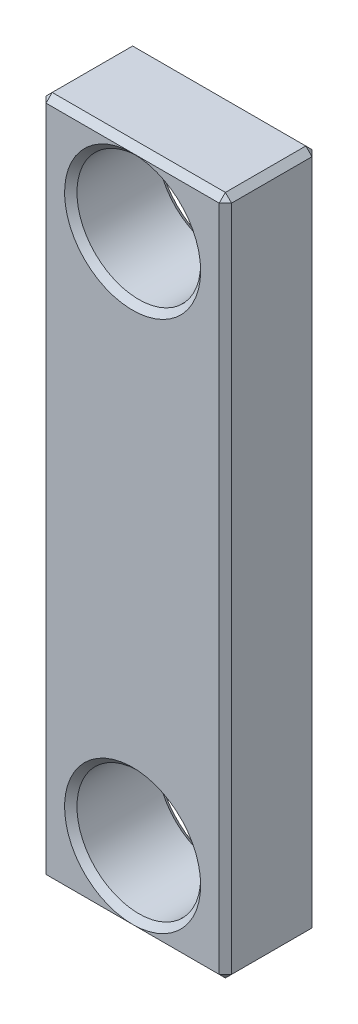
ISO-10303-21;
HEADER;
FILE_DESCRIPTION(('STEP AP214'),'2;1');
FILE_NAME('part.step','',(''),(''),'','','');
FILE_SCHEMA(('AUTOMOTIVE_DESIGN { 1 0 10303 214 1 1 1 1 }'));
ENDSEC;
DATA;
#1=APPLICATION_CONTEXT('core data for automotive mechanical design processes');
#2=APPLICATION_PROTOCOL_DEFINITION('international standard','automotive_design',2000,#1);
#3=PRODUCT_CONTEXT('',#1,'mechanical');
#4=PRODUCT('Part','Part','',(#3));
#5=PRODUCT_RELATED_PRODUCT_CATEGORY('part','',(#4));
#6=PRODUCT_DEFINITION_FORMATION('','',#4);
#7=PRODUCT_DEFINITION_CONTEXT('part definition',#1,'design');
#8=PRODUCT_DEFINITION('design','',#6,#7);
#9=PRODUCT_DEFINITION_SHAPE('','',#8);
#10=(LENGTH_UNIT() NAMED_UNIT(*) SI_UNIT(.MILLI.,.METRE.));
#11=(NAMED_UNIT(*) PLANE_ANGLE_UNIT() SI_UNIT($,.RADIAN.));
#12=(NAMED_UNIT(*) SI_UNIT($,.STERADIAN.) SOLID_ANGLE_UNIT());
#13=UNCERTAINTY_MEASURE_WITH_UNIT(LENGTH_MEASURE(1.E-05),#10,'distance_accuracy_value','');
#14=(GEOMETRIC_REPRESENTATION_CONTEXT(3) GLOBAL_UNCERTAINTY_ASSIGNED_CONTEXT((#13)) GLOBAL_UNIT_ASSIGNED_CONTEXT((#10,
#11,#12)) REPRESENTATION_CONTEXT('',''));
#15=CARTESIAN_POINT('',(0.,0.,0.));
#16=DIRECTION('',(0.,0.,1.));
#17=DIRECTION('',(1.,0.,0.));
#18=AXIS2_PLACEMENT_3D('',#15,#16,#17);
#19=CARTESIAN_POINT('',(0.,0.,15.));
#20=DIRECTION('',(0.,0.,1.));
#21=DIRECTION('',(1.,0.,0.));
#22=AXIS2_PLACEMENT_3D('',#19,#20,#21);
#23=PLANE('',#22);
#24=DIRECTION('',(0.,-1.,0.));
#25=VECTOR('',#24,1.);
#26=CARTESIAN_POINT('',(-14.,-55.,15.));
#27=LINE('',#26,#25);
#28=CARTESIAN_POINT('',(-14.,54.,15.));
#29=VERTEX_POINT('',#28);
#30=CARTESIAN_POINT('',(-14.,-54.,15.));
#31=VERTEX_POINT('',#30);
#32=EDGE_CURVE('E264',#29,#31,#27,.T.);
#33=ORIENTED_EDGE('',*,*,#32,.T.);
#34=DIRECTION('',(1.,0.,0.));
#35=VECTOR('',#34,1.);
#36=CARTESIAN_POINT('',(15.,-54.,15.));
#37=LINE('',#36,#35);
#38=CARTESIAN_POINT('',(0.,-54.,15.));
#39=VERTEX_POINT('',#38);
#40=EDGE_CURVE('E267',#31,#39,#37,.T.);
#41=ORIENTED_EDGE('',*,*,#40,.T.);
#42=CARTESIAN_POINT('',(0.,-43.,15.));
#43=DIRECTION('',(0.,0.,1.));
#44=DIRECTION('',(1.,0.,0.));
#45=AXIS2_PLACEMENT_3D('',#42,#43,#44);
#46=CIRCLE('',#45,11.);
#47=CARTESIAN_POINT('',(11.,-43.,15.));
#48=VERTEX_POINT('',#47);
#49=EDGE_CURVE('E237',#39,#48,#46,.F.);
#50=ORIENTED_EDGE('',*,*,#49,.T.);
#51=CARTESIAN_POINT('',(0.,-43.,15.));
#52=DIRECTION('',(0.,0.,1.));
#53=DIRECTION('',(1.,0.,0.));
#54=AXIS2_PLACEMENT_3D('',#51,#52,#53);
#55=CIRCLE('',#54,11.);
#56=EDGE_CURVE('E240',#48,#39,#55,.F.);
#57=ORIENTED_EDGE('',*,*,#56,.T.);
#58=DIRECTION('',(1.,0.,0.));
#59=VECTOR('',#58,1.);
#60=CARTESIAN_POINT('',(15.,-54.,15.));
#61=LINE('',#60,#59);
#62=CARTESIAN_POINT('',(14.,-54.,15.));
#63=VERTEX_POINT('',#62);
#64=EDGE_CURVE('E244',#39,#63,#61,.T.);
#65=ORIENTED_EDGE('',*,*,#64,.T.);
#66=DIRECTION('',(0.,1.,0.));
#67=VECTOR('',#66,1.);
#68=CARTESIAN_POINT('',(14.,55.,15.));
#69=LINE('',#68,#67);
#70=CARTESIAN_POINT('',(14.,54.,15.));
#71=VERTEX_POINT('',#70);
#72=EDGE_CURVE('E247',#63,#71,#69,.T.);
#73=ORIENTED_EDGE('',*,*,#72,.T.);
#74=DIRECTION('',(-1.,0.,0.));
#75=VECTOR('',#74,1.);
#76=CARTESIAN_POINT('',(-15.,54.,15.));
#77=LINE('',#76,#75);
#78=CARTESIAN_POINT('',(0.,54.,15.));
#79=VERTEX_POINT('',#78);
#80=EDGE_CURVE('E250',#71,#79,#77,.T.);
#81=ORIENTED_EDGE('',*,*,#80,.T.);
#82=CARTESIAN_POINT('',(0.,43.,15.));
#83=DIRECTION('',(0.,0.,1.));
#84=DIRECTION('',(1.,0.,0.));
#85=AXIS2_PLACEMENT_3D('',#82,#83,#84);
#86=CIRCLE('',#85,11.);
#87=CARTESIAN_POINT('',(11.,43.,15.));
#88=VERTEX_POINT('',#87);
#89=EDGE_CURVE('E254',#79,#88,#86,.F.);
#90=ORIENTED_EDGE('',*,*,#89,.T.);
#91=CARTESIAN_POINT('',(0.,43.,15.));
#92=DIRECTION('',(0.,0.,1.));
#93=DIRECTION('',(1.,0.,0.));
#94=AXIS2_PLACEMENT_3D('',#91,#92,#93);
#95=CIRCLE('',#94,11.);
#96=EDGE_CURVE('E257',#88,#79,#95,.F.);
#97=ORIENTED_EDGE('',*,*,#96,.T.);
#98=DIRECTION('',(-1.,0.,0.));
#99=VECTOR('',#98,1.);
#100=CARTESIAN_POINT('',(-15.,54.,15.));
#101=LINE('',#100,#99);
#102=EDGE_CURVE('E261',#79,#29,#101,.T.);
#103=ORIENTED_EDGE('',*,*,#102,.T.);
#104=EDGE_LOOP('',(#33,#41,#50,#57,#65,#73,#81,#90,#97,#103));
#105=FACE_BOUND('',#104,.T.);
#106=ADVANCED_FACE('F39',(#105),#23,.T.);
#107=CARTESIAN_POINT('',(0.,0.,0.));
#108=DIRECTION('',(0.,0.,1.));
#109=DIRECTION('',(1.,0.,0.));
#110=AXIS2_PLACEMENT_3D('',#107,#108,#109);
#111=PLANE('',#110);
#112=DIRECTION('',(0.,-1.,0.));
#113=VECTOR('',#112,1.);
#114=CARTESIAN_POINT('',(14.,0.,0.));
#115=LINE('',#114,#113);
#116=CARTESIAN_POINT('',(14.,54.,0.));
#117=VERTEX_POINT('',#116);
#118=CARTESIAN_POINT('',(14.,-54.,0.));
#119=VERTEX_POINT('',#118);
#120=EDGE_CURVE('E57',#117,#119,#115,.T.);
#121=ORIENTED_EDGE('',*,*,#120,.T.);
#122=DIRECTION('',(-1.,0.,0.));
#123=VECTOR('',#122,1.);
#124=CARTESIAN_POINT('',(0.,-54.,0.));
#125=LINE('',#124,#123);
#126=CARTESIAN_POINT('',(0.,-54.,0.));
#127=VERTEX_POINT('',#126);
#128=EDGE_CURVE('E298',#119,#127,#125,.T.);
#129=ORIENTED_EDGE('',*,*,#128,.T.);
#130=CARTESIAN_POINT('',(0.,-43.,0.));
#131=DIRECTION('',(0.,0.,1.));
#132=DIRECTION('',(1.,0.,0.));
#133=AXIS2_PLACEMENT_3D('',#130,#131,#132);
#134=CIRCLE('',#133,11.);
#135=CARTESIAN_POINT('',(11.,-43.,0.));
#136=VERTEX_POINT('',#135);
#137=EDGE_CURVE('E271',#127,#136,#134,.T.);
#138=ORIENTED_EDGE('',*,*,#137,.T.);
#139=CARTESIAN_POINT('',(0.,-43.,0.));
#140=DIRECTION('',(0.,0.,1.));
#141=DIRECTION('',(1.,0.,0.));
#142=AXIS2_PLACEMENT_3D('',#139,#140,#141);
#143=CIRCLE('',#142,11.);
#144=EDGE_CURVE('E274',#136,#127,#143,.T.);
#145=ORIENTED_EDGE('',*,*,#144,.T.);
#146=DIRECTION('',(-1.,0.,0.));
#147=VECTOR('',#146,1.);
#148=CARTESIAN_POINT('',(0.,-54.,0.));
#149=LINE('',#148,#147);
#150=CARTESIAN_POINT('',(-14.,-54.,0.));
#151=VERTEX_POINT('',#150);
#152=EDGE_CURVE('E278',#127,#151,#149,.T.);
#153=ORIENTED_EDGE('',*,*,#152,.T.);
#154=DIRECTION('',(0.,1.,0.));
#155=VECTOR('',#154,1.);
#156=CARTESIAN_POINT('',(-14.,0.,0.));
#157=LINE('',#156,#155);
#158=CARTESIAN_POINT('',(-14.,54.,0.));
#159=VERTEX_POINT('',#158);
#160=EDGE_CURVE('E281',#151,#159,#157,.T.);
#161=ORIENTED_EDGE('',*,*,#160,.T.);
#162=DIRECTION('',(1.,0.,0.));
#163=VECTOR('',#162,1.);
#164=CARTESIAN_POINT('',(0.,54.,0.));
#165=LINE('',#164,#163);
#166=CARTESIAN_POINT('',(0.,54.,0.));
#167=VERTEX_POINT('',#166);
#168=EDGE_CURVE('E284',#159,#167,#165,.T.);
#169=ORIENTED_EDGE('',*,*,#168,.T.);
#170=CARTESIAN_POINT('',(0.,43.,0.));
#171=DIRECTION('',(0.,0.,1.));
#172=DIRECTION('',(1.,0.,0.));
#173=AXIS2_PLACEMENT_3D('',#170,#171,#172);
#174=CIRCLE('',#173,11.);
#175=CARTESIAN_POINT('',(11.,43.,0.));
#176=VERTEX_POINT('',#175);
#177=EDGE_CURVE('E288',#167,#176,#174,.T.);
#178=ORIENTED_EDGE('',*,*,#177,.T.);
#179=CARTESIAN_POINT('',(0.,43.,0.));
#180=DIRECTION('',(0.,0.,1.));
#181=DIRECTION('',(1.,0.,0.));
#182=AXIS2_PLACEMENT_3D('',#179,#180,#181);
#183=CIRCLE('',#182,11.);
#184=EDGE_CURVE('E291',#176,#167,#183,.T.);
#185=ORIENTED_EDGE('',*,*,#184,.T.);
#186=DIRECTION('',(1.,0.,0.));
#187=VECTOR('',#186,1.);
#188=CARTESIAN_POINT('',(0.,54.,0.));
#189=LINE('',#188,#187);
#190=EDGE_CURVE('E62',#167,#117,#189,.T.);
#191=ORIENTED_EDGE('',*,*,#190,.T.);
#192=EDGE_LOOP('',(#121,#129,#138,#145,#153,#161,#169,#178,#185,#191));
#193=FACE_BOUND('',#192,.T.);
#194=ADVANCED_FACE('F433',(#193),#111,.F.);
#195=CARTESIAN_POINT('',(15.,55.,15.));
#196=DIRECTION('',(-1.,0.,0.));
#197=DIRECTION('',(0.,-1.,0.));
#198=AXIS2_PLACEMENT_3D('',#195,#196,#197);
#199=PLANE('',#198);
#200=DIRECTION('',(0.,1.,0.));
#201=VECTOR('',#200,1.);
#202=CARTESIAN_POINT('',(15.,55.,1.00000000000001));
#203=LINE('',#202,#201);
#204=CARTESIAN_POINT('',(15.,-54.,1.00000000000001));
#205=VERTEX_POINT('',#204);
#206=CARTESIAN_POINT('',(15.,54.,1.00000000000001));
#207=VERTEX_POINT('',#206);
#208=EDGE_CURVE('E197',#205,#207,#203,.T.);
#209=ORIENTED_EDGE('',*,*,#208,.T.);
#210=DIRECTION('',(0.,0.,1.));
#211=VECTOR('',#210,1.);
#212=CARTESIAN_POINT('',(15.,54.,15.));
#213=LINE('',#212,#211);
#214=CARTESIAN_POINT('',(15.,54.,14.));
#215=VERTEX_POINT('',#214);
#216=EDGE_CURVE('E162',#207,#215,#213,.T.);
#217=ORIENTED_EDGE('',*,*,#216,.T.);
#218=DIRECTION('',(0.,-1.,0.));
#219=VECTOR('',#218,1.);
#220=CARTESIAN_POINT('',(15.,-55.,14.));
#221=LINE('',#220,#219);
#222=CARTESIAN_POINT('',(15.,-54.,14.));
#223=VERTEX_POINT('',#222);
#224=EDGE_CURVE('E206',#215,#223,#221,.T.);
#225=ORIENTED_EDGE('',*,*,#224,.T.);
#226=DIRECTION('',(0.,0.,-1.));
#227=VECTOR('',#226,1.);
#228=CARTESIAN_POINT('',(15.,-54.,15.));
#229=LINE('',#228,#227);
#230=EDGE_CURVE('E203',#223,#205,#229,.T.);
#231=ORIENTED_EDGE('',*,*,#230,.T.);
#232=EDGE_LOOP('',(#209,#217,#225,#231));
#233=FACE_BOUND('',#232,.T.);
#234=ADVANCED_FACE('F435',(#233),#199,.F.);
#235=CARTESIAN_POINT('',(-15.,55.,15.));
#236=DIRECTION('',(0.,-1.,0.));
#237=DIRECTION('',(0.,0.,-1.));
#238=AXIS2_PLACEMENT_3D('',#235,#236,#237);
#239=PLANE('',#238);
#240=DIRECTION('',(0.,0.,1.));
#241=VECTOR('',#240,1.);
#242=CARTESIAN_POINT('',(-14.,55.,15.));
#243=LINE('',#242,#241);
#244=CARTESIAN_POINT('',(-14.,55.,1.00000000000001));
#245=VERTEX_POINT('',#244);
#246=CARTESIAN_POINT('',(-14.,55.,14.));
#247=VERTEX_POINT('',#246);
#248=EDGE_CURVE('E187',#245,#247,#243,.T.);
#249=ORIENTED_EDGE('',*,*,#248,.T.);
#250=DIRECTION('',(1.,0.,0.));
#251=VECTOR('',#250,1.);
#252=CARTESIAN_POINT('',(15.,55.,14.));
#253=LINE('',#252,#251);
#254=CARTESIAN_POINT('',(14.,55.,14.));
#255=VERTEX_POINT('',#254);
#256=EDGE_CURVE('E191',#247,#255,#253,.T.);
#257=ORIENTED_EDGE('',*,*,#256,.T.);
#258=DIRECTION('',(0.,0.,-1.));
#259=VECTOR('',#258,1.);
#260=CARTESIAN_POINT('',(14.,55.,15.));
#261=LINE('',#260,#259);
#262=CARTESIAN_POINT('',(14.,55.,1.00000000000001));
#263=VERTEX_POINT('',#262);
#264=EDGE_CURVE('E160',#255,#263,#261,.T.);
#265=ORIENTED_EDGE('',*,*,#264,.T.);
#266=DIRECTION('',(-1.,0.,0.));
#267=VECTOR('',#266,1.);
#268=CARTESIAN_POINT('',(-15.,55.,1.00000000000001));
#269=LINE('',#268,#267);
#270=EDGE_CURVE('E179',#263,#245,#269,.T.);
#271=ORIENTED_EDGE('',*,*,#270,.T.);
#272=EDGE_LOOP('',(#249,#257,#265,#271));
#273=FACE_BOUND('',#272,.T.);
#274=ADVANCED_FACE('F189',(#273),#239,.F.);
#275=CARTESIAN_POINT('',(-15.,55.,15.));
#276=DIRECTION('',(1.,0.,0.));
#277=DIRECTION('',(0.,1.,0.));
#278=AXIS2_PLACEMENT_3D('',#275,#276,#277);
#279=PLANE('',#278);
#280=DIRECTION('',(0.,0.,1.));
#281=VECTOR('',#280,1.);
#282=CARTESIAN_POINT('',(-15.,-54.,15.));
#283=LINE('',#282,#281);
#284=CARTESIAN_POINT('',(-15.,-54.,1.00000000000001));
#285=VERTEX_POINT('',#284);
#286=CARTESIAN_POINT('',(-15.,-54.,14.));
#287=VERTEX_POINT('',#286);
#288=EDGE_CURVE('E214',#285,#287,#283,.T.);
#289=ORIENTED_EDGE('',*,*,#288,.T.);
#290=DIRECTION('',(0.,1.,0.));
#291=VECTOR('',#290,1.);
#292=CARTESIAN_POINT('',(-15.,55.,14.));
#293=LINE('',#292,#291);
#294=CARTESIAN_POINT('',(-15.,54.,14.));
#295=VERTEX_POINT('',#294);
#296=EDGE_CURVE('E221',#287,#295,#293,.T.);
#297=ORIENTED_EDGE('',*,*,#296,.T.);
#298=DIRECTION('',(0.,0.,-1.));
#299=VECTOR('',#298,1.);
#300=CARTESIAN_POINT('',(-15.,54.,15.));
#301=LINE('',#300,#299);
#302=CARTESIAN_POINT('',(-15.,54.,1.00000000000001));
#303=VERTEX_POINT('',#302);
#304=EDGE_CURVE('E217',#295,#303,#301,.T.);
#305=ORIENTED_EDGE('',*,*,#304,.T.);
#306=DIRECTION('',(0.,-1.,0.));
#307=VECTOR('',#306,1.);
#308=CARTESIAN_POINT('',(-15.,55.,1.00000000000001));
#309=LINE('',#308,#307);
#310=EDGE_CURVE('E211',#303,#285,#309,.T.);
#311=ORIENTED_EDGE('',*,*,#310,.T.);
#312=EDGE_LOOP('',(#289,#297,#305,#311));
#313=FACE_BOUND('',#312,.T.);
#314=ADVANCED_FACE('F449',(#313),#279,.F.);
#315=CARTESIAN_POINT('',(-15.,-55.,15.));
#316=DIRECTION('',(0.,1.,0.));
#317=DIRECTION('',(0.,0.,1.));
#318=AXIS2_PLACEMENT_3D('',#315,#316,#317);
#319=PLANE('',#318);
#320=DIRECTION('',(-1.,0.,0.));
#321=VECTOR('',#320,1.);
#322=CARTESIAN_POINT('',(-15.,-55.,14.));
#323=LINE('',#322,#321);
#324=CARTESIAN_POINT('',(14.,-55.,14.));
#325=VERTEX_POINT('',#324);
#326=CARTESIAN_POINT('',(-14.,-55.,14.));
#327=VERTEX_POINT('',#326);
#328=EDGE_CURVE('E230',#325,#327,#323,.T.);
#329=ORIENTED_EDGE('',*,*,#328,.T.);
#330=DIRECTION('',(0.,0.,-1.));
#331=VECTOR('',#330,1.);
#332=CARTESIAN_POINT('',(-14.,-55.,15.));
#333=LINE('',#332,#331);
#334=CARTESIAN_POINT('',(-14.,-55.,1.00000000000001));
#335=VERTEX_POINT('',#334);
#336=EDGE_CURVE('E233',#327,#335,#333,.T.);
#337=ORIENTED_EDGE('',*,*,#336,.T.);
#338=DIRECTION('',(1.,0.,0.));
#339=VECTOR('',#338,1.);
#340=CARTESIAN_POINT('',(-15.,-55.,1.00000000000001));
#341=LINE('',#340,#339);
#342=CARTESIAN_POINT('',(14.,-55.,1.00000000000001));
#343=VERTEX_POINT('',#342);
#344=EDGE_CURVE('E224',#335,#343,#341,.T.);
#345=ORIENTED_EDGE('',*,*,#344,.T.);
#346=DIRECTION('',(0.,0.,1.));
#347=VECTOR('',#346,1.);
#348=CARTESIAN_POINT('',(14.,-55.,15.));
#349=LINE('',#348,#347);
#350=EDGE_CURVE('E227',#343,#325,#349,.T.);
#351=ORIENTED_EDGE('',*,*,#350,.T.);
#352=EDGE_LOOP('',(#329,#337,#345,#351));
#353=FACE_BOUND('',#352,.T.);
#354=ADVANCED_FACE('F446',(#353),#319,.F.);
#355=CARTESIAN_POINT('',(0.,43.,15.));
#356=DIRECTION('',(0.,0.,-1.));
#357=DIRECTION('',(-1.,0.,0.));
#358=AXIS2_PLACEMENT_3D('',#355,#356,#357);
#359=CYLINDRICAL_SURFACE('',#358,10.);
#360=CARTESIAN_POINT('',(0.,43.,14.));
#361=DIRECTION('',(0.,0.,1.));
#362=DIRECTION('',(1.,0.,0.));
#363=AXIS2_PLACEMENT_3D('',#360,#361,#362);
#364=CIRCLE('',#363,10.);
#365=CARTESIAN_POINT('',(10.,43.,14.));
#366=VERTEX_POINT('',#365);
#367=EDGE_CURVE('E305',#366,#366,#364,.T.);
#368=ORIENTED_EDGE('',*,*,#367,.T.);
#369=EDGE_LOOP('',(#368));
#370=FACE_BOUND('',#369,.T.);
#371=CARTESIAN_POINT('',(0.,43.,1.00000000000003));
#372=DIRECTION('',(0.,0.,1.));
#373=DIRECTION('',(1.,0.,0.));
#374=AXIS2_PLACEMENT_3D('',#371,#372,#373);
#375=CIRCLE('',#374,10.);
#376=CARTESIAN_POINT('',(10.,43.,1.00000000000003));
#377=VERTEX_POINT('',#376);
#378=EDGE_CURVE('E301',#377,#377,#375,.F.);
#379=ORIENTED_EDGE('',*,*,#378,.T.);
#380=EDGE_LOOP('',(#379));
#381=FACE_BOUND('',#380,.T.);
#382=ADVANCED_FACE('F422',(#370,#381),#359,.F.);
#383=CARTESIAN_POINT('',(0.,-43.,15.));
#384=DIRECTION('',(0.,0.,-1.));
#385=DIRECTION('',(-1.,0.,0.));
#386=AXIS2_PLACEMENT_3D('',#383,#384,#385);
#387=CYLINDRICAL_SURFACE('',#386,10.);
#388=CARTESIAN_POINT('',(0.,-43.,14.));
#389=DIRECTION('',(0.,0.,1.));
#390=DIRECTION('',(1.,0.,0.));
#391=AXIS2_PLACEMENT_3D('',#388,#389,#390);
#392=CIRCLE('',#391,10.);
#393=CARTESIAN_POINT('',(9.99999999999999,-43.,14.));
#394=VERTEX_POINT('',#393);
#395=EDGE_CURVE('E11',#394,#394,#392,.T.);
#396=ORIENTED_EDGE('',*,*,#395,.T.);
#397=EDGE_LOOP('',(#396));
#398=FACE_BOUND('',#397,.T.);
#399=CARTESIAN_POINT('',(0.,-43.,1.00000000000003));
#400=DIRECTION('',(0.,0.,1.));
#401=DIRECTION('',(1.,0.,0.));
#402=AXIS2_PLACEMENT_3D('',#399,#400,#401);
#403=CIRCLE('',#402,10.);
#404=CARTESIAN_POINT('',(9.99999999999999,-43.,1.00000000000003));
#405=VERTEX_POINT('',#404);
#406=EDGE_CURVE('E49',#405,#405,#403,.F.);
#407=ORIENTED_EDGE('',*,*,#406,.T.);
#408=EDGE_LOOP('',(#407));
#409=FACE_BOUND('',#408,.T.);
#410=ADVANCED_FACE('F418',(#398,#409),#387,.F.);
#411=CARTESIAN_POINT('',(-14.,-55.,15.));
#412=DIRECTION('',(0.707106781186542,0.707106781186552,0.));
#413=DIRECTION('',(0.,0.,-1.));
#414=AXIS2_PLACEMENT_3D('',#411,#412,#413);
#415=PLANE('',#414);
#416=DIRECTION('',(-0.707106781186552,0.707106781186543,0.));
#417=VECTOR('',#416,1.);
#418=CARTESIAN_POINT('',(-15.,-54.,14.));
#419=LINE('',#418,#417);
#420=EDGE_CURVE('E43',#287,#327,#419,.F.);
#421=ORIENTED_EDGE('',*,*,#420,.F.);
#422=ORIENTED_EDGE('',*,*,#288,.F.);
#423=DIRECTION('',(0.707106781186552,-0.707106781186543,0.));
#424=VECTOR('',#423,1.);
#425=CARTESIAN_POINT('',(-14.,-55.,1.00000000000001));
#426=LINE('',#425,#424);
#427=EDGE_CURVE('E383',#335,#285,#426,.F.);
#428=ORIENTED_EDGE('',*,*,#427,.F.);
#429=ORIENTED_EDGE('',*,*,#336,.F.);
#430=EDGE_LOOP('',(#421,#422,#428,#429));
#431=FACE_BOUND('',#430,.T.);
#432=ADVANCED_FACE('F421',(#431),#415,.F.);
#433=CARTESIAN_POINT('',(-15.,-54.,14.));
#434=DIRECTION('',(-0.577350269189618,-0.577350269189626,0.577350269189634));
#435=DIRECTION('',(0.,-0.707106781186552,-0.707106781186543));
#436=AXIS2_PLACEMENT_3D('',#433,#434,#435);
#437=PLANE('',#436);
#438=DIRECTION('',(-0.707106781186553,0.,-0.707106781186543));
#439=VECTOR('',#438,1.);
#440=CARTESIAN_POINT('',(-15.,-54.,14.));
#441=LINE('',#440,#439);
#442=EDGE_CURVE('E376',#287,#31,#441,.F.);
#443=ORIENTED_EDGE('',*,*,#442,.F.);
#444=ORIENTED_EDGE('',*,*,#420,.T.);
#445=DIRECTION('',(0.,0.707106781186552,0.707106781186543));
#446=VECTOR('',#445,1.);
#447=CARTESIAN_POINT('',(-14.,-54.5,14.5));
#448=LINE('',#447,#446);
#449=EDGE_CURVE('E380',#31,#327,#448,.F.);
#450=ORIENTED_EDGE('',*,*,#449,.F.);
#451=EDGE_LOOP('',(#443,#444,#450));
#452=FACE_BOUND('',#451,.T.);
#453=ADVANCED_FACE('F396',(#452),#437,.T.);
#454=CARTESIAN_POINT('',(-14.,-55.,1.00000000000001));
#455=DIRECTION('',(-0.577350269189626,-0.577350269189634,-0.577350269189618));
#456=DIRECTION('',(0.707106781186552,-0.707106781186543,0.));
#457=AXIS2_PLACEMENT_3D('',#454,#455,#456);
#458=PLANE('',#457);
#459=DIRECTION('',(0.,0.707106781186543,-0.707106781186552));
#460=VECTOR('',#459,1.);
#461=CARTESIAN_POINT('',(-14.,-55.,1.00000000000001));
#462=LINE('',#461,#460);
#463=EDGE_CURVE('E368',#335,#151,#462,.T.);
#464=ORIENTED_EDGE('',*,*,#463,.F.);
#465=ORIENTED_EDGE('',*,*,#427,.T.);
#466=DIRECTION('',(-0.707106781186543,0.,0.707106781186552));
#467=VECTOR('',#466,1.);
#468=CARTESIAN_POINT('',(-14.5,-54.,0.500000000000007));
#469=LINE('',#468,#467);
#470=EDGE_CURVE('E372',#151,#285,#469,.T.);
#471=ORIENTED_EDGE('',*,*,#470,.F.);
#472=EDGE_LOOP('',(#464,#465,#471));
#473=FACE_BOUND('',#472,.T.);
#474=ADVANCED_FACE('F515',(#473),#458,.T.);
#475=CARTESIAN_POINT('',(0.,-54.,15.));
#476=DIRECTION('',(0.,-0.707106781186542,0.707106781186552));
#477=DIRECTION('',(-1.,0.,0.));
#478=AXIS2_PLACEMENT_3D('',#475,#476,#477);
#479=PLANE('',#478);
#480=ORIENTED_EDGE('',*,*,#449,.T.);
#481=ORIENTED_EDGE('',*,*,#328,.F.);
#482=DIRECTION('',(0.,-0.707106781186552,-0.707106781186543));
#483=VECTOR('',#482,1.);
#484=CARTESIAN_POINT('',(14.,-54.,15.));
#485=LINE('',#484,#483);
#486=EDGE_CURVE('E360',#63,#325,#485,.T.);
#487=ORIENTED_EDGE('',*,*,#486,.F.);
#488=ORIENTED_EDGE('',*,*,#64,.F.);
#489=ORIENTED_EDGE('',*,*,#40,.F.);
#490=EDGE_LOOP('',(#480,#481,#487,#488,#489));
#491=FACE_BOUND('',#490,.T.);
#492=ADVANCED_FACE('F404',(#491),#479,.T.);
#493=CARTESIAN_POINT('',(-14.,0.,15.));
#494=DIRECTION('',(-0.707106781186542,0.,0.707106781186552));
#495=DIRECTION('',(0.,1.,0.));
#496=AXIS2_PLACEMENT_3D('',#493,#494,#495);
#497=PLANE('',#496);
#498=ORIENTED_EDGE('',*,*,#442,.T.);
#499=ORIENTED_EDGE('',*,*,#32,.F.);
#500=DIRECTION('',(0.707106781186552,0.,0.707106781186543));
#501=VECTOR('',#500,1.);
#502=CARTESIAN_POINT('',(-14.5,54.,14.5));
#503=LINE('',#502,#501);
#504=EDGE_CURVE('E356',#295,#29,#503,.T.);
#505=ORIENTED_EDGE('',*,*,#504,.F.);
#506=ORIENTED_EDGE('',*,*,#296,.F.);
#507=EDGE_LOOP('',(#498,#499,#505,#506));
#508=FACE_BOUND('',#507,.T.);
#509=ADVANCED_FACE('F508',(#508),#497,.T.);
#510=CARTESIAN_POINT('',(-15.,54.,15.));
#511=DIRECTION('',(0.707106781186552,-0.707106781186542,0.));
#512=DIRECTION('',(0.,0.,-1.));
#513=AXIS2_PLACEMENT_3D('',#510,#511,#512);
#514=PLANE('',#513);
#515=DIRECTION('',(-0.707106781186543,-0.707106781186552,0.));
#516=VECTOR('',#515,1.);
#517=CARTESIAN_POINT('',(-15.,54.,1.00000000000001));
#518=LINE('',#517,#516);
#519=EDGE_CURVE('E348',#303,#245,#518,.F.);
#520=ORIENTED_EDGE('',*,*,#519,.F.);
#521=ORIENTED_EDGE('',*,*,#304,.F.);
#522=DIRECTION('',(0.707106781186543,0.707106781186552,0.));
#523=VECTOR('',#522,1.);
#524=CARTESIAN_POINT('',(-14.,55.,14.));
#525=LINE('',#524,#523);
#526=EDGE_CURVE('E352',#247,#295,#525,.F.);
#527=ORIENTED_EDGE('',*,*,#526,.F.);
#528=ORIENTED_EDGE('',*,*,#248,.F.);
#529=EDGE_LOOP('',(#520,#521,#527,#528));
#530=FACE_BOUND('',#529,.T.);
#531=ADVANCED_FACE('F504',(#530),#514,.F.);
#532=CARTESIAN_POINT('',(-15.,55.,1.00000000000001));
#533=DIRECTION('',(0.707106781186552,0.,0.707106781186542));
#534=DIRECTION('',(0.,-1.,0.));
#535=AXIS2_PLACEMENT_3D('',#532,#533,#534);
#536=PLANE('',#535);
#537=ORIENTED_EDGE('',*,*,#470,.T.);
#538=ORIENTED_EDGE('',*,*,#310,.F.);
#539=DIRECTION('',(0.707106781186543,0.,-0.707106781186552));
#540=VECTOR('',#539,1.);
#541=CARTESIAN_POINT('',(-15.,54.,1.00000000000001));
#542=LINE('',#541,#540);
#543=EDGE_CURVE('E345',#159,#303,#542,.F.);
#544=ORIENTED_EDGE('',*,*,#543,.F.);
#545=ORIENTED_EDGE('',*,*,#160,.F.);
#546=EDGE_LOOP('',(#537,#538,#544,#545));
#547=FACE_BOUND('',#546,.T.);
#548=ADVANCED_FACE('F501',(#547),#536,.F.);
#549=CARTESIAN_POINT('',(-15.,-55.,1.00000000000001));
#550=DIRECTION('',(0.,0.707106781186552,0.707106781186542));
#551=DIRECTION('',(1.,0.,0.));
#552=AXIS2_PLACEMENT_3D('',#549,#550,#551);
#553=PLANE('',#552);
#554=ORIENTED_EDGE('',*,*,#152,.F.);
#555=ORIENTED_EDGE('',*,*,#128,.F.);
#556=DIRECTION('',(0.,-0.707106781186543,0.707106781186552));
#557=VECTOR('',#556,1.);
#558=CARTESIAN_POINT('',(14.,-54.5,0.500000000000007));
#559=LINE('',#558,#557);
#560=EDGE_CURVE('E341',#343,#119,#559,.F.);
#561=ORIENTED_EDGE('',*,*,#560,.F.);
#562=ORIENTED_EDGE('',*,*,#344,.F.);
#563=ORIENTED_EDGE('',*,*,#463,.T.);
#564=EDGE_LOOP('',(#554,#555,#561,#562,#563));
#565=FACE_BOUND('',#564,.T.);
#566=ADVANCED_FACE('F431',(#565),#553,.F.);
#567=CARTESIAN_POINT('',(15.,-54.,15.));
#568=DIRECTION('',(-0.707106781186552,0.707106781186542,0.));
#569=DIRECTION('',(0.,0.,-1.));
#570=AXIS2_PLACEMENT_3D('',#567,#568,#569);
#571=PLANE('',#570);
#572=DIRECTION('',(-0.707106781186543,-0.707106781186552,0.));
#573=VECTOR('',#572,1.);
#574=CARTESIAN_POINT('',(14.5,-54.5,14.));
#575=LINE('',#574,#573);
#576=EDGE_CURVE('E364',#325,#223,#575,.F.);
#577=ORIENTED_EDGE('',*,*,#576,.F.);
#578=ORIENTED_EDGE('',*,*,#350,.F.);
#579=DIRECTION('',(0.707106781186543,0.707106781186552,0.));
#580=VECTOR('',#579,1.);
#581=CARTESIAN_POINT('',(15.,-54.,1.00000000000001));
#582=LINE('',#581,#580);
#583=EDGE_CURVE('E337',#205,#343,#582,.F.);
#584=ORIENTED_EDGE('',*,*,#583,.F.);
#585=ORIENTED_EDGE('',*,*,#230,.F.);
#586=EDGE_LOOP('',(#577,#578,#584,#585));
#587=FACE_BOUND('',#586,.T.);
#588=ADVANCED_FACE('F494',(#587),#571,.F.);
#589=CARTESIAN_POINT('',(14.,-54.,15.));
#590=DIRECTION('',(0.577350269189634,-0.577350269189618,0.577350269189626));
#591=DIRECTION('',(0.707106781186543,0.,-0.707106781186552));
#592=AXIS2_PLACEMENT_3D('',#589,#590,#591);
#593=PLANE('',#592);
#594=ORIENTED_EDGE('',*,*,#486,.T.);
#595=ORIENTED_EDGE('',*,*,#576,.T.);
#596=DIRECTION('',(-0.707106781186543,0.,0.707106781186552));
#597=VECTOR('',#596,1.);
#598=CARTESIAN_POINT('',(14.,-54.,15.));
#599=LINE('',#598,#597);
#600=EDGE_CURVE('E333',#63,#223,#599,.F.);
#601=ORIENTED_EDGE('',*,*,#600,.F.);
#602=EDGE_LOOP('',(#594,#595,#601));
#603=FACE_BOUND('',#602,.T.);
#604=ADVANCED_FACE('F490',(#603),#593,.T.);
#605=CARTESIAN_POINT('',(-14.,55.,14.));
#606=DIRECTION('',(-0.577350269189626,0.577350269189618,0.577350269189634));
#607=DIRECTION('',(0.707106781186552,0.,0.707106781186543));
#608=AXIS2_PLACEMENT_3D('',#605,#606,#607);
#609=PLANE('',#608);
#610=ORIENTED_EDGE('',*,*,#526,.T.);
#611=ORIENTED_EDGE('',*,*,#504,.T.);
#612=DIRECTION('',(0.,0.707106781186552,-0.707106781186543));
#613=VECTOR('',#612,1.);
#614=CARTESIAN_POINT('',(-14.,55.,14.));
#615=LINE('',#614,#613);
#616=EDGE_CURVE('E329',#247,#29,#615,.F.);
#617=ORIENTED_EDGE('',*,*,#616,.F.);
#618=EDGE_LOOP('',(#610,#611,#617));
#619=FACE_BOUND('',#618,.T.);
#620=ADVANCED_FACE('F486',(#619),#609,.T.);
#621=CARTESIAN_POINT('',(-15.,54.,1.00000000000001));
#622=DIRECTION('',(-0.577350269189634,0.577350269189626,-0.577350269189618));
#623=DIRECTION('',(-0.707106781186543,-0.707106781186552,0.));
#624=AXIS2_PLACEMENT_3D('',#621,#622,#623);
#625=PLANE('',#624);
#626=ORIENTED_EDGE('',*,*,#543,.T.);
#627=ORIENTED_EDGE('',*,*,#519,.T.);
#628=DIRECTION('',(0.,0.707106781186543,0.707106781186552));
#629=VECTOR('',#628,1.);
#630=CARTESIAN_POINT('',(-14.,54.5,0.500000000000007));
#631=LINE('',#630,#629);
#632=EDGE_CURVE('E183',#159,#245,#631,.T.);
#633=ORIENTED_EDGE('',*,*,#632,.F.);
#634=EDGE_LOOP('',(#626,#627,#633));
#635=FACE_BOUND('',#634,.T.);
#636=ADVANCED_FACE('F482',(#635),#625,.T.);
#637=CARTESIAN_POINT('',(15.,-54.,1.00000000000001));
#638=DIRECTION('',(0.577350269189634,-0.577350269189626,-0.577350269189618));
#639=DIRECTION('',(0.707106781186543,0.707106781186552,0.));
#640=AXIS2_PLACEMENT_3D('',#637,#638,#639);
#641=PLANE('',#640);
#642=ORIENTED_EDGE('',*,*,#583,.T.);
#643=ORIENTED_EDGE('',*,*,#560,.T.);
#644=DIRECTION('',(-0.707106781186543,0.,-0.707106781186552));
#645=VECTOR('',#644,1.);
#646=CARTESIAN_POINT('',(15.,-54.,1.00000000000001));
#647=LINE('',#646,#645);
#648=EDGE_CURVE('E323',#205,#119,#647,.T.);
#649=ORIENTED_EDGE('',*,*,#648,.F.);
#650=EDGE_LOOP('',(#642,#643,#649));
#651=FACE_BOUND('',#650,.T.);
#652=ADVANCED_FACE('F478',(#651),#641,.T.);
#653=CARTESIAN_POINT('',(14.,0.,15.));
#654=DIRECTION('',(0.707106781186552,0.,0.707106781186542));
#655=DIRECTION('',(0.,-1.,0.));
#656=AXIS2_PLACEMENT_3D('',#653,#654,#655);
#657=PLANE('',#656);
#658=ORIENTED_EDGE('',*,*,#600,.T.);
#659=ORIENTED_EDGE('',*,*,#224,.F.);
#660=DIRECTION('',(0.707106781186543,0.,-0.707106781186552));
#661=VECTOR('',#660,1.);
#662=CARTESIAN_POINT('',(15.,54.,14.));
#663=LINE('',#662,#661);
#664=EDGE_CURVE('E319',#71,#215,#663,.T.);
#665=ORIENTED_EDGE('',*,*,#664,.F.);
#666=ORIENTED_EDGE('',*,*,#72,.F.);
#667=EDGE_LOOP('',(#658,#659,#665,#666));
#668=FACE_BOUND('',#667,.T.);
#669=ADVANCED_FACE('F474',(#668),#657,.T.);
#670=CARTESIAN_POINT('',(0.,54.,15.));
#671=DIRECTION('',(0.,0.707106781186542,0.707106781186552));
#672=DIRECTION('',(1.,0.,0.));
#673=AXIS2_PLACEMENT_3D('',#670,#671,#672);
#674=PLANE('',#673);
#675=ORIENTED_EDGE('',*,*,#102,.F.);
#676=ORIENTED_EDGE('',*,*,#80,.F.);
#677=DIRECTION('',(0.,-0.707106781186552,0.707106781186543));
#678=VECTOR('',#677,1.);
#679=CARTESIAN_POINT('',(14.,54.5,14.5));
#680=LINE('',#679,#678);
#681=EDGE_CURVE('E176',#255,#71,#680,.T.);
#682=ORIENTED_EDGE('',*,*,#681,.F.);
#683=ORIENTED_EDGE('',*,*,#256,.F.);
#684=ORIENTED_EDGE('',*,*,#616,.T.);
#685=EDGE_LOOP('',(#675,#676,#682,#683,#684));
#686=FACE_BOUND('',#685,.T.);
#687=ADVANCED_FACE('F471',(#686),#674,.T.);
#688=CARTESIAN_POINT('',(-15.,55.,1.00000000000001));
#689=DIRECTION('',(0.,-0.707106781186552,0.707106781186542));
#690=DIRECTION('',(-1.,0.,0.));
#691=AXIS2_PLACEMENT_3D('',#688,#689,#690);
#692=PLANE('',#691);
#693=ORIENTED_EDGE('',*,*,#632,.T.);
#694=ORIENTED_EDGE('',*,*,#270,.F.);
#695=DIRECTION('',(0.,-0.707106781186543,-0.707106781186552));
#696=VECTOR('',#695,1.);
#697=CARTESIAN_POINT('',(14.,55.,1.00000000000001));
#698=LINE('',#697,#696);
#699=EDGE_CURVE('E169',#117,#263,#698,.F.);
#700=ORIENTED_EDGE('',*,*,#699,.F.);
#701=ORIENTED_EDGE('',*,*,#190,.F.);
#702=ORIENTED_EDGE('',*,*,#168,.F.);
#703=EDGE_LOOP('',(#693,#694,#700,#701,#702));
#704=FACE_BOUND('',#703,.T.);
#705=ADVANCED_FACE('F180',(#704),#692,.F.);
#706=CARTESIAN_POINT('',(15.,55.,1.00000000000001));
#707=DIRECTION('',(-0.707106781186552,0.,0.707106781186542));
#708=DIRECTION('',(0.,1.,0.));
#709=AXIS2_PLACEMENT_3D('',#706,#707,#708);
#710=PLANE('',#709);
#711=ORIENTED_EDGE('',*,*,#648,.T.);
#712=ORIENTED_EDGE('',*,*,#120,.F.);
#713=DIRECTION('',(0.707106781186543,0.,0.707106781186553));
#714=VECTOR('',#713,1.);
#715=CARTESIAN_POINT('',(14.5,54.,0.500000000000007));
#716=LINE('',#715,#714);
#717=EDGE_CURVE('E173',#207,#117,#716,.F.);
#718=ORIENTED_EDGE('',*,*,#717,.F.);
#719=ORIENTED_EDGE('',*,*,#208,.F.);
#720=EDGE_LOOP('',(#711,#712,#718,#719));
#721=FACE_BOUND('',#720,.T.);
#722=ADVANCED_FACE('F464',(#721),#710,.F.);
#723=CARTESIAN_POINT('',(15.,54.,14.));
#724=DIRECTION('',(0.577350269189634,0.577350269189618,0.577350269189626));
#725=DIRECTION('',(0.707106781186543,0.,-0.707106781186552));
#726=AXIS2_PLACEMENT_3D('',#723,#724,#725);
#727=PLANE('',#726);
#728=ORIENTED_EDGE('',*,*,#681,.T.);
#729=ORIENTED_EDGE('',*,*,#664,.T.);
#730=DIRECTION('',(0.707106781186543,-0.707106781186552,0.));
#731=VECTOR('',#730,1.);
#732=CARTESIAN_POINT('',(15.,54.,14.));
#733=LINE('',#732,#731);
#734=EDGE_CURVE('E166',#255,#215,#733,.T.);
#735=ORIENTED_EDGE('',*,*,#734,.F.);
#736=EDGE_LOOP('',(#728,#729,#735));
#737=FACE_BOUND('',#736,.T.);
#738=ADVANCED_FACE('F461',(#737),#727,.T.);
#739=CARTESIAN_POINT('',(14.,55.,1.00000000000001));
#740=DIRECTION('',(0.577350269189634,0.577350269189626,-0.577350269189618));
#741=DIRECTION('',(-0.707106781186543,0.707106781186552,0.));
#742=AXIS2_PLACEMENT_3D('',#739,#740,#741);
#743=PLANE('',#742);
#744=ORIENTED_EDGE('',*,*,#717,.T.);
#745=ORIENTED_EDGE('',*,*,#699,.T.);
#746=DIRECTION('',(-0.707106781186543,0.707106781186552,0.));
#747=VECTOR('',#746,1.);
#748=CARTESIAN_POINT('',(14.,55.,1.00000000000001));
#749=LINE('',#748,#747);
#750=EDGE_CURVE('E156',#207,#263,#749,.T.);
#751=ORIENTED_EDGE('',*,*,#750,.F.);
#752=EDGE_LOOP('',(#744,#745,#751));
#753=FACE_BOUND('',#752,.T.);
#754=ADVANCED_FACE('F171',(#753),#743,.T.);
#755=CARTESIAN_POINT('',(14.,55.,15.));
#756=DIRECTION('',(-0.707106781186552,-0.707106781186542,0.));
#757=DIRECTION('',(0.,0.,-1.));
#758=AXIS2_PLACEMENT_3D('',#755,#756,#757);
#759=PLANE('',#758);
#760=ORIENTED_EDGE('',*,*,#734,.T.);
#761=ORIENTED_EDGE('',*,*,#216,.F.);
#762=ORIENTED_EDGE('',*,*,#750,.T.);
#763=ORIENTED_EDGE('',*,*,#264,.F.);
#764=EDGE_LOOP('',(#760,#761,#762,#763));
#765=FACE_BOUND('',#764,.T.);
#766=ADVANCED_FACE('F158',(#765),#759,.F.);
#767=CARTESIAN_POINT('',(0.,43.,14.));
#768=DIRECTION('',(0.,0.,1.));
#769=DIRECTION('',(1.,0.,0.));
#770=AXIS2_PLACEMENT_3D('',#767,#768,#769);
#771=CONICAL_SURFACE('',#770,10.,0.785398163397445);
#772=ORIENTED_EDGE('',*,*,#89,.F.);
#773=ORIENTED_EDGE('',*,*,#96,.F.);
#774=EDGE_LOOP('',(#772,#773));
#775=FACE_BOUND('',#774,.T.);
#776=ORIENTED_EDGE('',*,*,#367,.F.);
#777=EDGE_LOOP('',(#776));
#778=FACE_BOUND('',#777,.T.);
#779=ADVANCED_FACE('F458',(#775,#778),#771,.F.);
#780=CARTESIAN_POINT('',(0.,43.,0.));
#781=DIRECTION('',(0.,0.,-1.));
#782=DIRECTION('',(-1.,0.,0.));
#783=AXIS2_PLACEMENT_3D('',#780,#781,#782);
#784=CONICAL_SURFACE('',#783,11.,0.785398163397445);
#785=ORIENTED_EDGE('',*,*,#378,.F.);
#786=EDGE_LOOP('',(#785));
#787=FACE_BOUND('',#786,.T.);
#788=ORIENTED_EDGE('',*,*,#177,.F.);
#789=ORIENTED_EDGE('',*,*,#184,.F.);
#790=EDGE_LOOP('',(#788,#789));
#791=FACE_BOUND('',#790,.T.);
#792=ADVANCED_FACE('F415',(#787,#791),#784,.F.);
#793=CARTESIAN_POINT('',(0.,-43.,14.));
#794=DIRECTION('',(0.,0.,1.));
#795=DIRECTION('',(1.,0.,0.));
#796=AXIS2_PLACEMENT_3D('',#793,#794,#795);
#797=CONICAL_SURFACE('',#796,10.,0.785398163397445);
#798=ORIENTED_EDGE('',*,*,#49,.F.);
#799=ORIENTED_EDGE('',*,*,#56,.F.);
#800=EDGE_LOOP('',(#798,#799));
#801=FACE_BOUND('',#800,.T.);
#802=ORIENTED_EDGE('',*,*,#395,.F.);
#803=EDGE_LOOP('',(#802));
#804=FACE_BOUND('',#803,.T.);
#805=ADVANCED_FACE('F412',(#801,#804),#797,.F.);
#806=CARTESIAN_POINT('',(0.,-43.,0.));
#807=DIRECTION('',(0.,0.,-1.));
#808=DIRECTION('',(-1.,0.,0.));
#809=AXIS2_PLACEMENT_3D('',#806,#807,#808);
#810=CONICAL_SURFACE('',#809,11.,0.785398163397445);
#811=ORIENTED_EDGE('',*,*,#406,.F.);
#812=EDGE_LOOP('',(#811));
#813=FACE_BOUND('',#812,.T.);
#814=ORIENTED_EDGE('',*,*,#137,.F.);
#815=ORIENTED_EDGE('',*,*,#144,.F.);
#816=EDGE_LOOP('',(#814,#815));
#817=FACE_BOUND('',#816,.T.);
#818=ADVANCED_FACE('F41',(#813,#817),#810,.F.);
#819=CLOSED_SHELL('',(#106,#194,#234,#274,#314,#354,#382,#410,#432,#453,#474,#492,#509,#531,
#548,#566,#588,#604,#620,#636,#652,#669,#687,#705,#722,#738,#754,#766,#779,#792,#805,#818));
#820=MANIFOLD_SOLID_BREP('B2',#819);
#821=ADVANCED_BREP_SHAPE_REPRESENTATION('',(#18,#820),#14);
#822=SHAPE_DEFINITION_REPRESENTATION(#9,#821);
ENDSEC;
END-ISO-10303-21;
